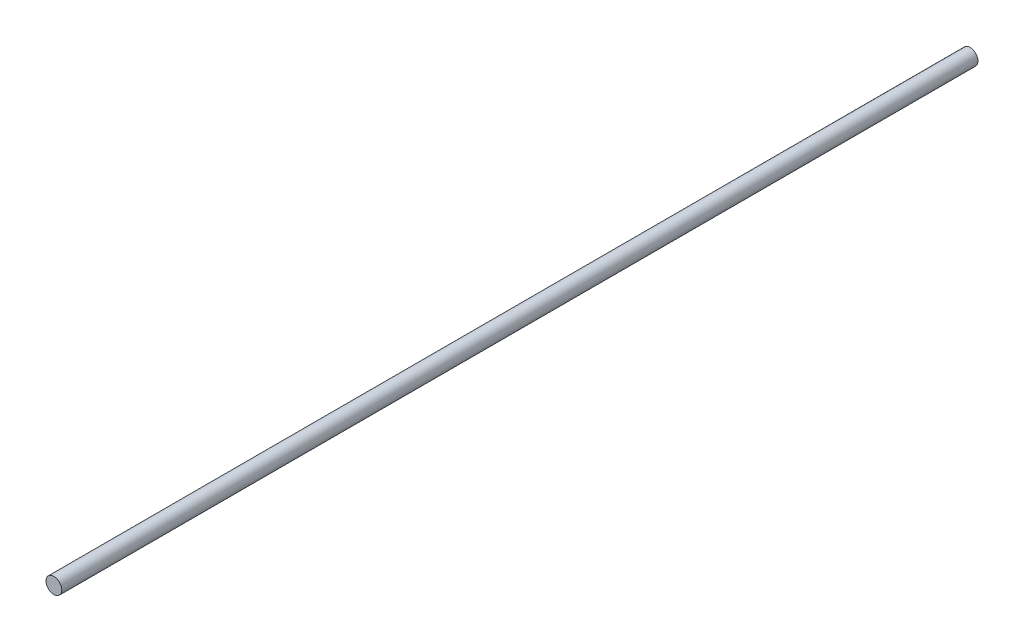
ISO-10303-21;
HEADER;
FILE_DESCRIPTION(('STEP AP214'),'2;1');
FILE_NAME('part.step','',(''),(''),'','','');
FILE_SCHEMA(('AUTOMOTIVE_DESIGN { 1 0 10303 214 1 1 1 1 }'));
ENDSEC;
DATA;
#1=APPLICATION_CONTEXT('core data for automotive mechanical design processes');
#2=APPLICATION_PROTOCOL_DEFINITION('international standard','automotive_design',2000,#1);
#3=PRODUCT_CONTEXT('',#1,'mechanical');
#4=PRODUCT('Part','Part','',(#3));
#5=PRODUCT_RELATED_PRODUCT_CATEGORY('part','',(#4));
#6=PRODUCT_DEFINITION_FORMATION('','',#4);
#7=PRODUCT_DEFINITION_CONTEXT('part definition',#1,'design');
#8=PRODUCT_DEFINITION('design','',#6,#7);
#9=PRODUCT_DEFINITION_SHAPE('','',#8);
#10=(LENGTH_UNIT() NAMED_UNIT(*) SI_UNIT(.MILLI.,.METRE.));
#11=(NAMED_UNIT(*) PLANE_ANGLE_UNIT() SI_UNIT($,.RADIAN.));
#12=(NAMED_UNIT(*) SI_UNIT($,.STERADIAN.) SOLID_ANGLE_UNIT());
#13=UNCERTAINTY_MEASURE_WITH_UNIT(LENGTH_MEASURE(1.E-05),#10,'distance_accuracy_value','');
#14=(GEOMETRIC_REPRESENTATION_CONTEXT(3) GLOBAL_UNCERTAINTY_ASSIGNED_CONTEXT((#13)) GLOBAL_UNIT_ASSIGNED_CONTEXT((#10,
#11,#12)) REPRESENTATION_CONTEXT('',''));
#15=CARTESIAN_POINT('',(0.,0.,0.));
#16=DIRECTION('',(0.,0.,1.));
#17=DIRECTION('',(1.,0.,0.));
#18=AXIS2_PLACEMENT_3D('',#15,#16,#17);
#19=CARTESIAN_POINT('',(0.,0.,580.));
#20=DIRECTION('',(0.,0.,-1.));
#21=DIRECTION('',(-1.,0.,0.));
#22=AXIS2_PLACEMENT_3D('',#19,#20,#21);
#23=CYLINDRICAL_SURFACE('',#22,5.);
#24=CARTESIAN_POINT('',(0.,0.,580.));
#25=DIRECTION('',(0.,0.,1.));
#26=DIRECTION('',(1.,0.,0.));
#27=AXIS2_PLACEMENT_3D('',#24,#25,#26);
#28=CIRCLE('',#27,5.);
#29=CARTESIAN_POINT('',(5.,0.,580.));
#30=VERTEX_POINT('',#29);
#31=EDGE_CURVE('E10',#30,#30,#28,.T.);
#32=ORIENTED_EDGE('',*,*,#31,.F.);
#33=EDGE_LOOP('',(#32));
#34=FACE_BOUND('',#33,.T.);
#35=CARTESIAN_POINT('',(0.,0.,0.));
#36=DIRECTION('',(0.,0.,1.));
#37=DIRECTION('',(1.,0.,0.));
#38=AXIS2_PLACEMENT_3D('',#35,#36,#37);
#39=CIRCLE('',#38,5.);
#40=CARTESIAN_POINT('',(5.,0.,0.));
#41=VERTEX_POINT('',#40);
#42=EDGE_CURVE('E34',#41,#41,#39,.T.);
#43=ORIENTED_EDGE('',*,*,#42,.T.);
#44=EDGE_LOOP('',(#43));
#45=FACE_BOUND('',#44,.T.);
#46=ADVANCED_FACE('F31',(#34,#45),#23,.T.);
#47=CARTESIAN_POINT('',(0.,0.,580.));
#48=DIRECTION('',(0.,0.,1.));
#49=DIRECTION('',(1.,0.,0.));
#50=AXIS2_PLACEMENT_3D('',#47,#48,#49);
#51=PLANE('',#50);
#52=ORIENTED_EDGE('',*,*,#31,.T.);
#53=EDGE_LOOP('',(#52));
#54=FACE_BOUND('',#53,.T.);
#55=ADVANCED_FACE('F46',(#54),#51,.T.);
#56=CARTESIAN_POINT('',(0.,0.,0.));
#57=DIRECTION('',(0.,0.,1.));
#58=DIRECTION('',(1.,0.,0.));
#59=AXIS2_PLACEMENT_3D('',#56,#57,#58);
#60=PLANE('',#59);
#61=ORIENTED_EDGE('',*,*,#42,.F.);
#62=EDGE_LOOP('',(#61));
#63=FACE_BOUND('',#62,.T.);
#64=ADVANCED_FACE('F44',(#63),#60,.F.);
#65=CLOSED_SHELL('',(#46,#55,#64));
#66=MANIFOLD_SOLID_BREP('B2',#65);
#67=ADVANCED_BREP_SHAPE_REPRESENTATION('',(#18,#66),#14);
#68=SHAPE_DEFINITION_REPRESENTATION(#9,#67);
ENDSEC;
END-ISO-10303-21;
